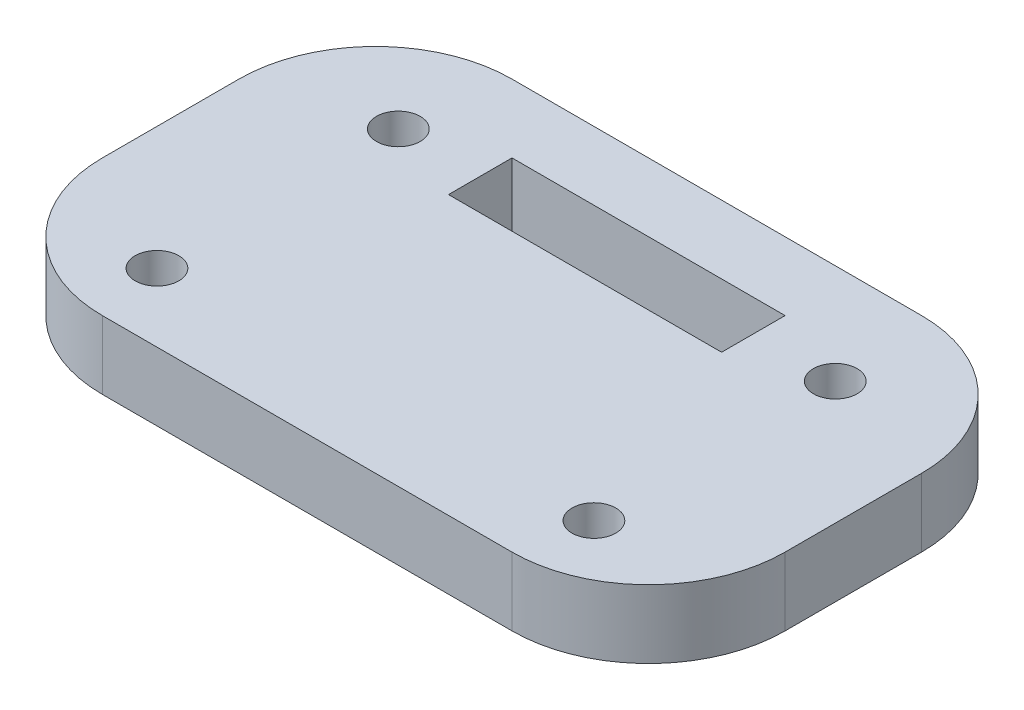
ISO-10303-21;
HEADER;
FILE_DESCRIPTION(('STEP AP214'),'2;1');
FILE_NAME('part.step','',(''),(''),'','','');
FILE_SCHEMA(('AUTOMOTIVE_DESIGN { 1 0 10303 214 1 1 1 1 }'));
ENDSEC;
DATA;
#1=APPLICATION_CONTEXT('core data for automotive mechanical design processes');
#2=APPLICATION_PROTOCOL_DEFINITION('international standard','automotive_design',2000,#1);
#3=PRODUCT_CONTEXT('',#1,'mechanical');
#4=PRODUCT('Part','Part','',(#3));
#5=PRODUCT_RELATED_PRODUCT_CATEGORY('part','',(#4));
#6=PRODUCT_DEFINITION_FORMATION('','',#4);
#7=PRODUCT_DEFINITION_CONTEXT('part definition',#1,'design');
#8=PRODUCT_DEFINITION('design','',#6,#7);
#9=PRODUCT_DEFINITION_SHAPE('','',#8);
#10=(LENGTH_UNIT() NAMED_UNIT(*) SI_UNIT(.MILLI.,.METRE.));
#11=(NAMED_UNIT(*) PLANE_ANGLE_UNIT() SI_UNIT($,.RADIAN.));
#12=(NAMED_UNIT(*) SI_UNIT($,.STERADIAN.) SOLID_ANGLE_UNIT());
#13=UNCERTAINTY_MEASURE_WITH_UNIT(LENGTH_MEASURE(1.E-05),#10,'distance_accuracy_value','');
#14=(GEOMETRIC_REPRESENTATION_CONTEXT(3) GLOBAL_UNCERTAINTY_ASSIGNED_CONTEXT((#13)) GLOBAL_UNIT_ASSIGNED_CONTEXT((#10,
#11,#12)) REPRESENTATION_CONTEXT('',''));
#15=CARTESIAN_POINT('',(0.,0.,0.));
#16=DIRECTION('',(0.,0.,1.));
#17=DIRECTION('',(1.,0.,0.));
#18=AXIS2_PLACEMENT_3D('',#15,#16,#17);
#19=CARTESIAN_POINT('',(10.,5.,-10.));
#20=DIRECTION('',(0.,-1.,0.));
#21=DIRECTION('',(0.,0.,-1.));
#22=AXIS2_PLACEMENT_3D('',#19,#20,#21);
#23=PLANE('',#22);
#24=CARTESIAN_POINT('',(10.,5.,-10.));
#25=DIRECTION('',(0.,1.,0.));
#26=DIRECTION('',(0.,0.,-1.));
#27=AXIS2_PLACEMENT_3D('',#24,#25,#26);
#28=CIRCLE('',#27,10.);
#29=CARTESIAN_POINT('',(0.,5.,-10.0000000000001));
#30=VERTEX_POINT('',#29);
#31=CARTESIAN_POINT('',(10.0000000000001,5.,0.));
#32=VERTEX_POINT('',#31);
#33=EDGE_CURVE('E161',#30,#32,#28,.T.);
#34=ORIENTED_EDGE('',*,*,#33,.T.);
#35=DIRECTION('',(1.,0.,0.));
#36=VECTOR('',#35,1.);
#37=CARTESIAN_POINT('',(10.0000000000001,5.,0.));
#38=LINE('',#37,#36);
#39=CARTESIAN_POINT('',(39.9999999999999,5.,0.));
#40=VERTEX_POINT('',#39);
#41=EDGE_CURVE('E164',#32,#40,#38,.T.);
#42=ORIENTED_EDGE('',*,*,#41,.T.);
#43=CARTESIAN_POINT('',(40.,5.,-10.));
#44=DIRECTION('',(0.,1.,0.));
#45=DIRECTION('',(0.,0.,1.));
#46=AXIS2_PLACEMENT_3D('',#43,#44,#45);
#47=CIRCLE('',#46,10.);
#48=CARTESIAN_POINT('',(50.,5.,-10.0000000000001));
#49=VERTEX_POINT('',#48);
#50=EDGE_CURVE('E167',#40,#49,#47,.T.);
#51=ORIENTED_EDGE('',*,*,#50,.T.);
#52=DIRECTION('',(0.,0.,-1.));
#53=VECTOR('',#52,1.);
#54=CARTESIAN_POINT('',(50.,5.,-10.0000000000001));
#55=LINE('',#54,#53);
#56=CARTESIAN_POINT('',(50.,5.,-19.9999999999999));
#57=VERTEX_POINT('',#56);
#58=EDGE_CURVE('E169',#49,#57,#55,.T.);
#59=ORIENTED_EDGE('',*,*,#58,.T.);
#60=CARTESIAN_POINT('',(40.,5.,-20.));
#61=DIRECTION('',(0.,1.,0.));
#62=DIRECTION('',(0.,0.,-1.));
#63=AXIS2_PLACEMENT_3D('',#60,#61,#62);
#64=CIRCLE('',#63,10.);
#65=CARTESIAN_POINT('',(39.9999999999999,5.,-30.));
#66=VERTEX_POINT('',#65);
#67=EDGE_CURVE('E171',#57,#66,#64,.T.);
#68=ORIENTED_EDGE('',*,*,#67,.T.);
#69=DIRECTION('',(-1.,0.,0.));
#70=VECTOR('',#69,1.);
#71=CARTESIAN_POINT('',(10.0000000000001,5.,-30.));
#72=LINE('',#71,#70);
#73=CARTESIAN_POINT('',(10.0000000000001,5.,-30.));
#74=VERTEX_POINT('',#73);
#75=EDGE_CURVE('E173',#66,#74,#72,.T.);
#76=ORIENTED_EDGE('',*,*,#75,.T.);
#77=CARTESIAN_POINT('',(10.,5.,-20.));
#78=DIRECTION('',(0.,1.,0.));
#79=DIRECTION('',(0.,0.,-1.));
#80=AXIS2_PLACEMENT_3D('',#77,#78,#79);
#81=CIRCLE('',#80,10.);
#82=CARTESIAN_POINT('',(0.,5.,-19.9999999999999));
#83=VERTEX_POINT('',#82);
#84=EDGE_CURVE('E175',#74,#83,#81,.T.);
#85=ORIENTED_EDGE('',*,*,#84,.T.);
#86=DIRECTION('',(0.,0.,1.));
#87=VECTOR('',#86,1.);
#88=CARTESIAN_POINT('',(0.,5.,-10.0000000000001));
#89=LINE('',#88,#87);
#90=EDGE_CURVE('E177',#83,#30,#89,.T.);
#91=ORIENTED_EDGE('',*,*,#90,.T.);
#92=EDGE_LOOP('',(#34,#42,#51,#59,#68,#76,#85,#91));
#93=FACE_BOUND('',#92,.T.);
#94=DIRECTION('',(0.,0.,1.));
#95=VECTOR('',#94,1.);
#96=CARTESIAN_POINT('',(15.,5.,-25.));
#97=LINE('',#96,#95);
#98=CARTESIAN_POINT('',(15.,5.,-25.));
#99=VERTEX_POINT('',#98);
#100=CARTESIAN_POINT('',(15.,5.,-20.35));
#101=VERTEX_POINT('',#100);
#102=EDGE_CURVE('E122',#99,#101,#97,.T.);
#103=ORIENTED_EDGE('',*,*,#102,.F.);
#104=DIRECTION('',(-1.,0.,0.));
#105=VECTOR('',#104,1.);
#106=CARTESIAN_POINT('',(15.,5.,-25.));
#107=LINE('',#106,#105);
#108=CARTESIAN_POINT('',(35.,5.,-25.));
#109=VERTEX_POINT('',#108);
#110=EDGE_CURVE('E145',#109,#99,#107,.T.);
#111=ORIENTED_EDGE('',*,*,#110,.F.);
#112=DIRECTION('',(0.,0.,-1.));
#113=VECTOR('',#112,1.);
#114=CARTESIAN_POINT('',(35.,5.,-25.));
#115=LINE('',#114,#113);
#116=CARTESIAN_POINT('',(35.,5.,-20.35));
#117=VERTEX_POINT('',#116);
#118=EDGE_CURVE('E143',#117,#109,#115,.T.);
#119=ORIENTED_EDGE('',*,*,#118,.F.);
#120=DIRECTION('',(1.,0.,0.));
#121=VECTOR('',#120,1.);
#122=CARTESIAN_POINT('',(15.,5.,-20.35));
#123=LINE('',#122,#121);
#124=EDGE_CURVE('E130',#101,#117,#123,.T.);
#125=ORIENTED_EDGE('',*,*,#124,.F.);
#126=EDGE_LOOP('',(#103,#111,#119,#125));
#127=FACE_BOUND('',#126,.T.);
#128=CARTESIAN_POINT('',(9.,5.,-5.));
#129=DIRECTION('',(0.,1.,0.));
#130=DIRECTION('',(0.,0.,1.));
#131=AXIS2_PLACEMENT_3D('',#128,#129,#130);
#132=CIRCLE('',#131,1.6);
#133=CARTESIAN_POINT('',(9.,5.,-3.4));
#134=VERTEX_POINT('',#133);
#135=EDGE_CURVE('E151',#134,#134,#132,.T.);
#136=ORIENTED_EDGE('',*,*,#135,.F.);
#137=EDGE_LOOP('',(#136));
#138=FACE_BOUND('',#137,.T.);
#139=CARTESIAN_POINT('',(41.,5.,-5.));
#140=DIRECTION('',(0.,1.,0.));
#141=DIRECTION('',(0.,0.,1.));
#142=AXIS2_PLACEMENT_3D('',#139,#140,#141);
#143=CIRCLE('',#142,1.6);
#144=CARTESIAN_POINT('',(41.,5.,-3.4));
#145=VERTEX_POINT('',#144);
#146=EDGE_CURVE('E323',#145,#145,#143,.T.);
#147=ORIENTED_EDGE('',*,*,#146,.F.);
#148=EDGE_LOOP('',(#147));
#149=FACE_BOUND('',#148,.T.);
#150=CARTESIAN_POINT('',(9.00000000000001,5.,-22.675));
#151=DIRECTION('',(0.,1.,0.));
#152=DIRECTION('',(0.,0.,1.));
#153=AXIS2_PLACEMENT_3D('',#150,#151,#152);
#154=CIRCLE('',#153,1.6);
#155=CARTESIAN_POINT('',(9.00000000000001,5.,-21.075));
#156=VERTEX_POINT('',#155);
#157=EDGE_CURVE('E317',#156,#156,#154,.T.);
#158=ORIENTED_EDGE('',*,*,#157,.F.);
#159=EDGE_LOOP('',(#158));
#160=FACE_BOUND('',#159,.T.);
#161=CARTESIAN_POINT('',(41.,5.,-22.675));
#162=DIRECTION('',(0.,1.,0.));
#163=DIRECTION('',(0.,0.,1.));
#164=AXIS2_PLACEMENT_3D('',#161,#162,#163);
#165=CIRCLE('',#164,1.6);
#166=CARTESIAN_POINT('',(41.,5.,-21.075));
#167=VERTEX_POINT('',#166);
#168=EDGE_CURVE('E308',#167,#167,#165,.T.);
#169=ORIENTED_EDGE('',*,*,#168,.F.);
#170=EDGE_LOOP('',(#169));
#171=FACE_BOUND('',#170,.T.);
#172=ADVANCED_FACE('F33',(#93,#127,#138,#149,#160,#171),#23,.F.);
#173=CARTESIAN_POINT('',(10.,0.,-10.));
#174=DIRECTION('',(0.,-1.,0.));
#175=DIRECTION('',(0.,0.,-1.));
#176=AXIS2_PLACEMENT_3D('',#173,#174,#175);
#177=PLANE('',#176);
#178=CARTESIAN_POINT('',(9.00000000000001,0.,-22.675));
#179=DIRECTION('',(0.,1.,0.));
#180=DIRECTION('',(0.,0.,1.));
#181=AXIS2_PLACEMENT_3D('',#178,#179,#180);
#182=CIRCLE('',#181,1.6);
#183=CARTESIAN_POINT('',(9.00000000000001,0.,-21.075));
#184=VERTEX_POINT('',#183);
#185=EDGE_CURVE('E314',#184,#184,#182,.T.);
#186=ORIENTED_EDGE('',*,*,#185,.T.);
#187=EDGE_LOOP('',(#186));
#188=FACE_BOUND('',#187,.T.);
#189=CARTESIAN_POINT('',(9.,0.,-5.));
#190=DIRECTION('',(0.,1.,0.));
#191=DIRECTION('',(0.,0.,1.));
#192=AXIS2_PLACEMENT_3D('',#189,#190,#191);
#193=CIRCLE('',#192,1.6);
#194=CARTESIAN_POINT('',(9.,0.,-3.4));
#195=VERTEX_POINT('',#194);
#196=EDGE_CURVE('E326',#195,#195,#193,.T.);
#197=ORIENTED_EDGE('',*,*,#196,.T.);
#198=EDGE_LOOP('',(#197));
#199=FACE_BOUND('',#198,.T.);
#200=CARTESIAN_POINT('',(10.,0.,-10.));
#201=DIRECTION('',(0.,1.,0.));
#202=DIRECTION('',(0.,0.,-1.));
#203=AXIS2_PLACEMENT_3D('',#200,#201,#202);
#204=CIRCLE('',#203,10.);
#205=CARTESIAN_POINT('',(0.,0.,-10.0000000000001));
#206=VERTEX_POINT('',#205);
#207=CARTESIAN_POINT('',(10.0000000000001,0.,0.));
#208=VERTEX_POINT('',#207);
#209=EDGE_CURVE('E138',#206,#208,#204,.T.);
#210=ORIENTED_EDGE('',*,*,#209,.F.);
#211=DIRECTION('',(0.,0.,1.));
#212=VECTOR('',#211,1.);
#213=CARTESIAN_POINT('',(0.,0.,-10.0000000000001));
#214=LINE('',#213,#212);
#215=CARTESIAN_POINT('',(0.,0.,-19.9999999999999));
#216=VERTEX_POINT('',#215);
#217=EDGE_CURVE('E165',#216,#206,#214,.T.);
#218=ORIENTED_EDGE('',*,*,#217,.F.);
#219=CARTESIAN_POINT('',(10.,0.,-20.));
#220=DIRECTION('',(0.,1.,0.));
#221=DIRECTION('',(0.,0.,-1.));
#222=AXIS2_PLACEMENT_3D('',#219,#220,#221);
#223=CIRCLE('',#222,10.);
#224=CARTESIAN_POINT('',(10.0000000000001,0.,-30.));
#225=VERTEX_POINT('',#224);
#226=EDGE_CURVE('E192',#225,#216,#223,.T.);
#227=ORIENTED_EDGE('',*,*,#226,.F.);
#228=DIRECTION('',(-1.,0.,0.));
#229=VECTOR('',#228,1.);
#230=CARTESIAN_POINT('',(10.0000000000001,0.,-30.));
#231=LINE('',#230,#229);
#232=CARTESIAN_POINT('',(39.9999999999999,0.,-30.));
#233=VERTEX_POINT('',#232);
#234=EDGE_CURVE('E190',#233,#225,#231,.T.);
#235=ORIENTED_EDGE('',*,*,#234,.F.);
#236=CARTESIAN_POINT('',(40.,0.,-20.));
#237=DIRECTION('',(0.,1.,0.));
#238=DIRECTION('',(0.,0.,-1.));
#239=AXIS2_PLACEMENT_3D('',#236,#237,#238);
#240=CIRCLE('',#239,10.);
#241=CARTESIAN_POINT('',(50.,0.,-19.9999999999999));
#242=VERTEX_POINT('',#241);
#243=EDGE_CURVE('E188',#242,#233,#240,.T.);
#244=ORIENTED_EDGE('',*,*,#243,.F.);
#245=DIRECTION('',(0.,0.,-1.));
#246=VECTOR('',#245,1.);
#247=CARTESIAN_POINT('',(50.,0.,-10.0000000000001));
#248=LINE('',#247,#246);
#249=CARTESIAN_POINT('',(50.,0.,-10.0000000000001));
#250=VERTEX_POINT('',#249);
#251=EDGE_CURVE('E186',#250,#242,#248,.T.);
#252=ORIENTED_EDGE('',*,*,#251,.F.);
#253=CARTESIAN_POINT('',(40.,0.,-10.));
#254=DIRECTION('',(0.,1.,0.));
#255=DIRECTION('',(0.,0.,1.));
#256=AXIS2_PLACEMENT_3D('',#253,#254,#255);
#257=CIRCLE('',#256,10.);
#258=CARTESIAN_POINT('',(39.9999999999999,0.,0.));
#259=VERTEX_POINT('',#258);
#260=EDGE_CURVE('E184',#259,#250,#257,.T.);
#261=ORIENTED_EDGE('',*,*,#260,.F.);
#262=DIRECTION('',(1.,0.,0.));
#263=VECTOR('',#262,1.);
#264=CARTESIAN_POINT('',(10.0000000000001,0.,0.));
#265=LINE('',#264,#263);
#266=EDGE_CURVE('E182',#208,#259,#265,.T.);
#267=ORIENTED_EDGE('',*,*,#266,.F.);
#268=EDGE_LOOP('',(#210,#218,#227,#235,#244,#252,#261,#267));
#269=FACE_BOUND('',#268,.T.);
#270=DIRECTION('',(-1.,0.,0.));
#271=VECTOR('',#270,1.);
#272=CARTESIAN_POINT('',(15.,0.,-25.));
#273=LINE('',#272,#271);
#274=CARTESIAN_POINT('',(35.,0.,-25.));
#275=VERTEX_POINT('',#274);
#276=CARTESIAN_POINT('',(15.,0.,-25.));
#277=VERTEX_POINT('',#276);
#278=EDGE_CURVE('E131',#275,#277,#273,.T.);
#279=ORIENTED_EDGE('',*,*,#278,.T.);
#280=DIRECTION('',(0.,0.,1.));
#281=VECTOR('',#280,1.);
#282=CARTESIAN_POINT('',(15.,0.,-25.));
#283=LINE('',#282,#281);
#284=CARTESIAN_POINT('',(15.,0.,-20.35));
#285=VERTEX_POINT('',#284);
#286=EDGE_CURVE('E56',#277,#285,#283,.T.);
#287=ORIENTED_EDGE('',*,*,#286,.T.);
#288=DIRECTION('',(1.,0.,0.));
#289=VECTOR('',#288,1.);
#290=CARTESIAN_POINT('',(15.,0.,-20.35));
#291=LINE('',#290,#289);
#292=CARTESIAN_POINT('',(35.,0.,-20.35));
#293=VERTEX_POINT('',#292);
#294=EDGE_CURVE('E137',#285,#293,#291,.T.);
#295=ORIENTED_EDGE('',*,*,#294,.T.);
#296=DIRECTION('',(0.,0.,-1.));
#297=VECTOR('',#296,1.);
#298=CARTESIAN_POINT('',(35.,0.,-25.));
#299=LINE('',#298,#297);
#300=EDGE_CURVE('E153',#293,#275,#299,.T.);
#301=ORIENTED_EDGE('',*,*,#300,.T.);
#302=EDGE_LOOP('',(#279,#287,#295,#301));
#303=FACE_BOUND('',#302,.T.);
#304=CARTESIAN_POINT('',(41.,0.,-5.));
#305=DIRECTION('',(0.,1.,0.));
#306=DIRECTION('',(0.,0.,1.));
#307=AXIS2_PLACEMENT_3D('',#304,#305,#306);
#308=CIRCLE('',#307,1.6);
#309=CARTESIAN_POINT('',(41.,0.,-3.4));
#310=VERTEX_POINT('',#309);
#311=EDGE_CURVE('E320',#310,#310,#308,.T.);
#312=ORIENTED_EDGE('',*,*,#311,.T.);
#313=EDGE_LOOP('',(#312));
#314=FACE_BOUND('',#313,.T.);
#315=CARTESIAN_POINT('',(41.,0.,-22.675));
#316=DIRECTION('',(0.,1.,0.));
#317=DIRECTION('',(0.,0.,1.));
#318=AXIS2_PLACEMENT_3D('',#315,#316,#317);
#319=CIRCLE('',#318,1.6);
#320=CARTESIAN_POINT('',(41.,0.,-21.075));
#321=VERTEX_POINT('',#320);
#322=EDGE_CURVE('E311',#321,#321,#319,.T.);
#323=ORIENTED_EDGE('',*,*,#322,.T.);
#324=EDGE_LOOP('',(#323));
#325=FACE_BOUND('',#324,.T.);
#326=ADVANCED_FACE('F222',(#188,#199,#269,#303,#314,#325),#177,.T.);
#327=CARTESIAN_POINT('',(10.,5.,-10.));
#328=DIRECTION('',(0.,-1.,0.));
#329=DIRECTION('',(0.,0.,-1.));
#330=AXIS2_PLACEMENT_3D('',#327,#328,#329);
#331=CYLINDRICAL_SURFACE('',#330,10.);
#332=ORIENTED_EDGE('',*,*,#209,.T.);
#333=DIRECTION('',(0.,-1.,0.));
#334=VECTOR('',#333,1.);
#335=CARTESIAN_POINT('',(10.0000000000001,5.,0.));
#336=LINE('',#335,#334);
#337=EDGE_CURVE('E11',#32,#208,#336,.T.);
#338=ORIENTED_EDGE('',*,*,#337,.F.);
#339=ORIENTED_EDGE('',*,*,#33,.F.);
#340=DIRECTION('',(0.,-1.,0.));
#341=VECTOR('',#340,1.);
#342=CARTESIAN_POINT('',(0.,5.,-10.0000000000001));
#343=LINE('',#342,#341);
#344=EDGE_CURVE('E179',#30,#206,#343,.T.);
#345=ORIENTED_EDGE('',*,*,#344,.T.);
#346=EDGE_LOOP('',(#332,#338,#339,#345));
#347=FACE_BOUND('',#346,.T.);
#348=ADVANCED_FACE('F35',(#347),#331,.T.);
#349=CARTESIAN_POINT('',(10.0000000000001,5.,0.));
#350=DIRECTION('',(0.,0.,-1.));
#351=DIRECTION('',(-1.,0.,0.));
#352=AXIS2_PLACEMENT_3D('',#349,#350,#351);
#353=PLANE('',#352);
#354=ORIENTED_EDGE('',*,*,#266,.T.);
#355=DIRECTION('',(0.,-1.,0.));
#356=VECTOR('',#355,1.);
#357=CARTESIAN_POINT('',(39.9999999999999,5.,0.));
#358=LINE('',#357,#356);
#359=EDGE_CURVE('E41',#40,#259,#358,.T.);
#360=ORIENTED_EDGE('',*,*,#359,.F.);
#361=ORIENTED_EDGE('',*,*,#41,.F.);
#362=ORIENTED_EDGE('',*,*,#337,.T.);
#363=EDGE_LOOP('',(#354,#360,#361,#362));
#364=FACE_BOUND('',#363,.T.);
#365=ADVANCED_FACE('F239',(#364),#353,.F.);
#366=CARTESIAN_POINT('',(40.,5.,-10.));
#367=DIRECTION('',(0.,-1.,0.));
#368=DIRECTION('',(0.,0.,-1.));
#369=AXIS2_PLACEMENT_3D('',#366,#367,#368);
#370=CYLINDRICAL_SURFACE('',#369,10.);
#371=ORIENTED_EDGE('',*,*,#260,.T.);
#372=DIRECTION('',(0.,-1.,0.));
#373=VECTOR('',#372,1.);
#374=CARTESIAN_POINT('',(50.,5.,-10.0000000000001));
#375=LINE('',#374,#373);
#376=EDGE_CURVE('E209',#49,#250,#375,.T.);
#377=ORIENTED_EDGE('',*,*,#376,.F.);
#378=ORIENTED_EDGE('',*,*,#50,.F.);
#379=ORIENTED_EDGE('',*,*,#359,.T.);
#380=EDGE_LOOP('',(#371,#377,#378,#379));
#381=FACE_BOUND('',#380,.T.);
#382=ADVANCED_FACE('F216',(#381),#370,.T.);
#383=CARTESIAN_POINT('',(50.,5.,-10.0000000000001));
#384=DIRECTION('',(-1.,0.,0.));
#385=DIRECTION('',(0.,0.,1.));
#386=AXIS2_PLACEMENT_3D('',#383,#384,#385);
#387=PLANE('',#386);
#388=ORIENTED_EDGE('',*,*,#251,.T.);
#389=DIRECTION('',(0.,-1.,0.));
#390=VECTOR('',#389,1.);
#391=CARTESIAN_POINT('',(50.,5.,-19.9999999999999));
#392=LINE('',#391,#390);
#393=EDGE_CURVE('E206',#57,#242,#392,.T.);
#394=ORIENTED_EDGE('',*,*,#393,.F.);
#395=ORIENTED_EDGE('',*,*,#58,.F.);
#396=ORIENTED_EDGE('',*,*,#376,.T.);
#397=EDGE_LOOP('',(#388,#394,#395,#396));
#398=FACE_BOUND('',#397,.T.);
#399=ADVANCED_FACE('F228',(#398),#387,.F.);
#400=CARTESIAN_POINT('',(40.,5.,-20.));
#401=DIRECTION('',(0.,-1.,0.));
#402=DIRECTION('',(0.,0.,-1.));
#403=AXIS2_PLACEMENT_3D('',#400,#401,#402);
#404=CYLINDRICAL_SURFACE('',#403,10.);
#405=ORIENTED_EDGE('',*,*,#243,.T.);
#406=DIRECTION('',(0.,-1.,0.));
#407=VECTOR('',#406,1.);
#408=CARTESIAN_POINT('',(39.9999999999999,5.,-30.));
#409=LINE('',#408,#407);
#410=EDGE_CURVE('E203',#66,#233,#409,.T.);
#411=ORIENTED_EDGE('',*,*,#410,.F.);
#412=ORIENTED_EDGE('',*,*,#67,.F.);
#413=ORIENTED_EDGE('',*,*,#393,.T.);
#414=EDGE_LOOP('',(#405,#411,#412,#413));
#415=FACE_BOUND('',#414,.T.);
#416=ADVANCED_FACE('F232',(#415),#404,.T.);
#417=CARTESIAN_POINT('',(10.0000000000001,5.,-30.));
#418=DIRECTION('',(0.,0.,1.));
#419=DIRECTION('',(1.,0.,0.));
#420=AXIS2_PLACEMENT_3D('',#417,#418,#419);
#421=PLANE('',#420);
#422=ORIENTED_EDGE('',*,*,#234,.T.);
#423=DIRECTION('',(0.,-1.,0.));
#424=VECTOR('',#423,1.);
#425=CARTESIAN_POINT('',(10.0000000000001,5.,-30.));
#426=LINE('',#425,#424);
#427=EDGE_CURVE('E200',#74,#225,#426,.T.);
#428=ORIENTED_EDGE('',*,*,#427,.F.);
#429=ORIENTED_EDGE('',*,*,#75,.F.);
#430=ORIENTED_EDGE('',*,*,#410,.T.);
#431=EDGE_LOOP('',(#422,#428,#429,#430));
#432=FACE_BOUND('',#431,.T.);
#433=ADVANCED_FACE('F252',(#432),#421,.F.);
#434=CARTESIAN_POINT('',(10.,5.,-20.));
#435=DIRECTION('',(0.,-1.,0.));
#436=DIRECTION('',(0.,0.,-1.));
#437=AXIS2_PLACEMENT_3D('',#434,#435,#436);
#438=CYLINDRICAL_SURFACE('',#437,10.);
#439=ORIENTED_EDGE('',*,*,#226,.T.);
#440=DIRECTION('',(0.,-1.,0.));
#441=VECTOR('',#440,1.);
#442=CARTESIAN_POINT('',(0.,5.,-19.9999999999999));
#443=LINE('',#442,#441);
#444=EDGE_CURVE('E197',#83,#216,#443,.T.);
#445=ORIENTED_EDGE('',*,*,#444,.F.);
#446=ORIENTED_EDGE('',*,*,#84,.F.);
#447=ORIENTED_EDGE('',*,*,#427,.T.);
#448=EDGE_LOOP('',(#439,#445,#446,#447));
#449=FACE_BOUND('',#448,.T.);
#450=ADVANCED_FACE('F250',(#449),#438,.T.);
#451=CARTESIAN_POINT('',(0.,5.,-10.0000000000001));
#452=DIRECTION('',(1.,0.,0.));
#453=DIRECTION('',(0.,0.,-1.));
#454=AXIS2_PLACEMENT_3D('',#451,#452,#453);
#455=PLANE('',#454);
#456=ORIENTED_EDGE('',*,*,#217,.T.);
#457=ORIENTED_EDGE('',*,*,#344,.F.);
#458=ORIENTED_EDGE('',*,*,#90,.F.);
#459=ORIENTED_EDGE('',*,*,#444,.T.);
#460=EDGE_LOOP('',(#456,#457,#458,#459));
#461=FACE_BOUND('',#460,.T.);
#462=ADVANCED_FACE('F245',(#461),#455,.F.);
#463=CARTESIAN_POINT('',(15.,5.,-25.));
#464=DIRECTION('',(1.,0.,0.));
#465=DIRECTION('',(0.,0.,-1.));
#466=AXIS2_PLACEMENT_3D('',#463,#464,#465);
#467=PLANE('',#466);
#468=ORIENTED_EDGE('',*,*,#286,.F.);
#469=DIRECTION('',(0.,-1.,0.));
#470=VECTOR('',#469,1.);
#471=CARTESIAN_POINT('',(15.,5.,-25.));
#472=LINE('',#471,#470);
#473=EDGE_CURVE('E126',#99,#277,#472,.T.);
#474=ORIENTED_EDGE('',*,*,#473,.F.);
#475=ORIENTED_EDGE('',*,*,#102,.T.);
#476=DIRECTION('',(0.,-1.,0.));
#477=VECTOR('',#476,1.);
#478=CARTESIAN_POINT('',(15.,5.,-20.35));
#479=LINE('',#478,#477);
#480=EDGE_CURVE('E125',#101,#285,#479,.T.);
#481=ORIENTED_EDGE('',*,*,#480,.T.);
#482=EDGE_LOOP('',(#468,#474,#475,#481));
#483=FACE_BOUND('',#482,.T.);
#484=ADVANCED_FACE('F124',(#483),#467,.T.);
#485=CARTESIAN_POINT('',(15.,5.,-20.35));
#486=DIRECTION('',(0.,0.,-1.));
#487=DIRECTION('',(-1.,0.,0.));
#488=AXIS2_PLACEMENT_3D('',#485,#486,#487);
#489=PLANE('',#488);
#490=ORIENTED_EDGE('',*,*,#294,.F.);
#491=ORIENTED_EDGE('',*,*,#480,.F.);
#492=ORIENTED_EDGE('',*,*,#124,.T.);
#493=DIRECTION('',(0.,-1.,0.));
#494=VECTOR('',#493,1.);
#495=CARTESIAN_POINT('',(35.,5.,-20.35));
#496=LINE('',#495,#494);
#497=EDGE_CURVE('E139',#117,#293,#496,.T.);
#498=ORIENTED_EDGE('',*,*,#497,.T.);
#499=EDGE_LOOP('',(#490,#491,#492,#498));
#500=FACE_BOUND('',#499,.T.);
#501=ADVANCED_FACE('F134',(#500),#489,.T.);
#502=CARTESIAN_POINT('',(35.,5.,-25.));
#503=DIRECTION('',(-1.,0.,0.));
#504=DIRECTION('',(0.,0.,1.));
#505=AXIS2_PLACEMENT_3D('',#502,#503,#504);
#506=PLANE('',#505);
#507=ORIENTED_EDGE('',*,*,#300,.F.);
#508=ORIENTED_EDGE('',*,*,#497,.F.);
#509=ORIENTED_EDGE('',*,*,#118,.T.);
#510=DIRECTION('',(0.,-1.,0.));
#511=VECTOR('',#510,1.);
#512=CARTESIAN_POINT('',(35.,5.,-25.));
#513=LINE('',#512,#511);
#514=EDGE_CURVE('E48',#109,#275,#513,.T.);
#515=ORIENTED_EDGE('',*,*,#514,.T.);
#516=EDGE_LOOP('',(#507,#508,#509,#515));
#517=FACE_BOUND('',#516,.T.);
#518=ADVANCED_FACE('F278',(#517),#506,.T.);
#519=CARTESIAN_POINT('',(15.,5.,-25.));
#520=DIRECTION('',(0.,0.,1.));
#521=DIRECTION('',(1.,0.,0.));
#522=AXIS2_PLACEMENT_3D('',#519,#520,#521);
#523=PLANE('',#522);
#524=ORIENTED_EDGE('',*,*,#278,.F.);
#525=ORIENTED_EDGE('',*,*,#514,.F.);
#526=ORIENTED_EDGE('',*,*,#110,.T.);
#527=ORIENTED_EDGE('',*,*,#473,.T.);
#528=EDGE_LOOP('',(#524,#525,#526,#527));
#529=FACE_BOUND('',#528,.T.);
#530=ADVANCED_FACE('F282',(#529),#523,.T.);
#531=CARTESIAN_POINT('',(9.,5.,-5.));
#532=DIRECTION('',(0.,-1.,0.));
#533=DIRECTION('',(0.,0.,-1.));
#534=AXIS2_PLACEMENT_3D('',#531,#532,#533);
#535=CYLINDRICAL_SURFACE('',#534,1.6);
#536=ORIENTED_EDGE('',*,*,#135,.T.);
#537=EDGE_LOOP('',(#536));
#538=FACE_BOUND('',#537,.T.);
#539=ORIENTED_EDGE('',*,*,#196,.F.);
#540=EDGE_LOOP('',(#539));
#541=FACE_BOUND('',#540,.T.);
#542=ADVANCED_FACE('F288',(#538,#541),#535,.F.);
#543=CARTESIAN_POINT('',(41.,5.,-5.));
#544=DIRECTION('',(0.,-1.,0.));
#545=DIRECTION('',(0.,0.,-1.));
#546=AXIS2_PLACEMENT_3D('',#543,#544,#545);
#547=CYLINDRICAL_SURFACE('',#546,1.6);
#548=ORIENTED_EDGE('',*,*,#146,.T.);
#549=EDGE_LOOP('',(#548));
#550=FACE_BOUND('',#549,.T.);
#551=ORIENTED_EDGE('',*,*,#311,.F.);
#552=EDGE_LOOP('',(#551));
#553=FACE_BOUND('',#552,.T.);
#554=ADVANCED_FACE('F291',(#550,#553),#547,.F.);
#555=CARTESIAN_POINT('',(9.00000000000001,5.,-22.675));
#556=DIRECTION('',(0.,-1.,0.));
#557=DIRECTION('',(0.,0.,-1.));
#558=AXIS2_PLACEMENT_3D('',#555,#556,#557);
#559=CYLINDRICAL_SURFACE('',#558,1.6);
#560=ORIENTED_EDGE('',*,*,#157,.T.);
#561=EDGE_LOOP('',(#560));
#562=FACE_BOUND('',#561,.T.);
#563=ORIENTED_EDGE('',*,*,#185,.F.);
#564=EDGE_LOOP('',(#563));
#565=FACE_BOUND('',#564,.T.);
#566=ADVANCED_FACE('F295',(#562,#565),#559,.F.);
#567=CARTESIAN_POINT('',(41.,5.,-22.675));
#568=DIRECTION('',(0.,-1.,0.));
#569=DIRECTION('',(0.,0.,-1.));
#570=AXIS2_PLACEMENT_3D('',#567,#568,#569);
#571=CYLINDRICAL_SURFACE('',#570,1.6);
#572=ORIENTED_EDGE('',*,*,#168,.T.);
#573=EDGE_LOOP('',(#572));
#574=FACE_BOUND('',#573,.T.);
#575=ORIENTED_EDGE('',*,*,#322,.F.);
#576=EDGE_LOOP('',(#575));
#577=FACE_BOUND('',#576,.T.);
#578=ADVANCED_FACE('F299',(#574,#577),#571,.F.);
#579=CLOSED_SHELL('',(#172,#326,#348,#365,#382,#399,#416,#433,#450,#462,#484,#501,#518,#530,
#542,#554,#566,#578));
#580=MANIFOLD_SOLID_BREP('B2',#579);
#581=ADVANCED_BREP_SHAPE_REPRESENTATION('',(#18,#580),#14);
#582=SHAPE_DEFINITION_REPRESENTATION(#9,#581);
ENDSEC;
END-ISO-10303-21;
